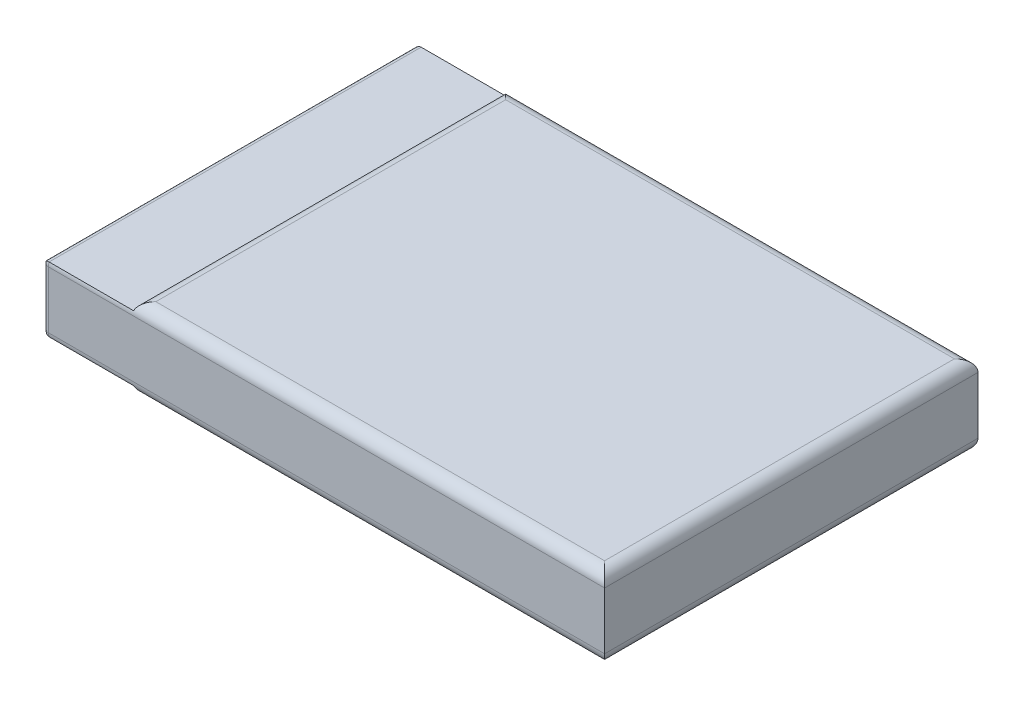
ISO-10303-21;
HEADER;
FILE_DESCRIPTION(('STEP AP214'),'2;1');
FILE_NAME('part.step','',(''),(''),'','','');
FILE_SCHEMA(('AUTOMOTIVE_DESIGN { 1 0 10303 214 1 1 1 1 }'));
ENDSEC;
DATA;
#1=APPLICATION_CONTEXT('core data for automotive mechanical design processes');
#2=APPLICATION_PROTOCOL_DEFINITION('international standard','automotive_design',2000,#1);
#3=PRODUCT_CONTEXT('',#1,'mechanical');
#4=PRODUCT('Part','Part','',(#3));
#5=PRODUCT_RELATED_PRODUCT_CATEGORY('part','',(#4));
#6=PRODUCT_DEFINITION_FORMATION('','',#4);
#7=PRODUCT_DEFINITION_CONTEXT('part definition',#1,'design');
#8=PRODUCT_DEFINITION('design','',#6,#7);
#9=PRODUCT_DEFINITION_SHAPE('','',#8);
#10=(LENGTH_UNIT() NAMED_UNIT(*) SI_UNIT(.MILLI.,.METRE.));
#11=(NAMED_UNIT(*) PLANE_ANGLE_UNIT() SI_UNIT($,.RADIAN.));
#12=(NAMED_UNIT(*) SI_UNIT($,.STERADIAN.) SOLID_ANGLE_UNIT());
#13=UNCERTAINTY_MEASURE_WITH_UNIT(LENGTH_MEASURE(1.E-05),#10,'distance_accuracy_value','');
#14=(GEOMETRIC_REPRESENTATION_CONTEXT(3) GLOBAL_UNCERTAINTY_ASSIGNED_CONTEXT((#13)) GLOBAL_UNIT_ASSIGNED_CONTEXT((#10,
#11,#12)) REPRESENTATION_CONTEXT('',''));
#15=CARTESIAN_POINT('',(0.,0.,0.));
#16=DIRECTION('',(0.,0.,1.));
#17=DIRECTION('',(1.,0.,0.));
#18=AXIS2_PLACEMENT_3D('',#15,#16,#17);
#19=CARTESIAN_POINT('',(15.24,5.207,-12.065));
#20=DIRECTION('',(-1.,0.,0.));
#21=DIRECTION('',(0.,0.,1.));
#22=AXIS2_PLACEMENT_3D('',#19,#20,#21);
#23=PLANE('',#22);
#24=DIRECTION('',(0.,-1.,0.));
#25=VECTOR('',#24,1.);
#26=CARTESIAN_POINT('',(15.24,5.207,-12.065));
#27=LINE('',#26,#25);
#28=CARTESIAN_POINT('',(15.24,4.445,-12.065));
#29=VERTEX_POINT('',#28);
#30=CARTESIAN_POINT('',(15.24,0.762000000000001,-12.065));
#31=VERTEX_POINT('',#30);
#32=EDGE_CURVE('E350',#29,#31,#27,.T.);
#33=ORIENTED_EDGE('',*,*,#32,.F.);
#34=DIRECTION('',(0.,0.,-1.));
#35=VECTOR('',#34,1.);
#36=CARTESIAN_POINT('',(15.24,4.445,12.065));
#37=LINE('',#36,#35);
#38=CARTESIAN_POINT('',(15.24,4.445,12.065));
#39=VERTEX_POINT('',#38);
#40=EDGE_CURVE('E338',#29,#39,#37,.F.);
#41=ORIENTED_EDGE('',*,*,#40,.T.);
#42=DIRECTION('',(0.,-1.,0.));
#43=VECTOR('',#42,1.);
#44=CARTESIAN_POINT('',(15.24,5.207,12.065));
#45=LINE('',#44,#43);
#46=CARTESIAN_POINT('',(15.24,0.762,12.065));
#47=VERTEX_POINT('',#46);
#48=EDGE_CURVE('E342',#39,#47,#45,.T.);
#49=ORIENTED_EDGE('',*,*,#48,.T.);
#50=DIRECTION('',(0.,0.,-1.));
#51=VECTOR('',#50,1.);
#52=CARTESIAN_POINT('',(15.24,0.762,-12.065));
#53=LINE('',#52,#51);
#54=EDGE_CURVE('E372',#47,#31,#53,.T.);
#55=ORIENTED_EDGE('',*,*,#54,.T.);
#56=EDGE_LOOP('',(#33,#41,#49,#55));
#57=FACE_BOUND('',#56,.T.);
#58=ADVANCED_FACE('F37',(#57),#23,.F.);
#59=CARTESIAN_POINT('',(-15.24,5.207,-12.065));
#60=DIRECTION('',(0.,0.,1.));
#61=DIRECTION('',(1.,0.,0.));
#62=AXIS2_PLACEMENT_3D('',#59,#60,#61);
#63=PLANE('',#62);
#64=DIRECTION('',(-1.,0.,0.));
#65=VECTOR('',#64,1.);
#66=CARTESIAN_POINT('',(-15.24,0.762,-12.065));
#67=LINE('',#66,#65);
#68=CARTESIAN_POINT('',(-20.701,0.762,-12.065));
#69=VERTEX_POINT('',#68);
#70=EDGE_CURVE('E195',#31,#69,#67,.T.);
#71=ORIENTED_EDGE('',*,*,#70,.T.);
#72=DIRECTION('',(0.,-1.,0.));
#73=VECTOR('',#72,1.);
#74=CARTESIAN_POINT('',(-20.701,4.445,-12.065));
#75=LINE('',#74,#73);
#76=CARTESIAN_POINT('',(-20.701,4.445,-12.065));
#77=VERTEX_POINT('',#76);
#78=EDGE_CURVE('E262',#69,#77,#75,.F.);
#79=ORIENTED_EDGE('',*,*,#78,.T.);
#80=DIRECTION('',(-1.,0.,0.));
#81=VECTOR('',#80,1.);
#82=CARTESIAN_POINT('',(15.24,4.445,-12.065));
#83=LINE('',#82,#81);
#84=EDGE_CURVE('E371',#77,#29,#83,.F.);
#85=ORIENTED_EDGE('',*,*,#84,.T.);
#86=ORIENTED_EDGE('',*,*,#32,.T.);
#87=EDGE_LOOP('',(#71,#79,#85,#86));
#88=FACE_BOUND('',#87,.T.);
#89=ADVANCED_FACE('F403',(#88),#63,.F.);
#90=CARTESIAN_POINT('',(-15.24,5.207,12.065));
#91=DIRECTION('',(0.,0.,-1.));
#92=DIRECTION('',(-1.,0.,0.));
#93=AXIS2_PLACEMENT_3D('',#90,#91,#92);
#94=PLANE('',#93);
#95=DIRECTION('',(1.,0.,0.));
#96=VECTOR('',#95,1.);
#97=CARTESIAN_POINT('',(-15.24,4.445,12.065));
#98=LINE('',#97,#96);
#99=CARTESIAN_POINT('',(-20.701,4.445,12.065));
#100=VERTEX_POINT('',#99);
#101=EDGE_CURVE('E366',#39,#100,#98,.F.);
#102=ORIENTED_EDGE('',*,*,#101,.T.);
#103=DIRECTION('',(0.,1.,0.));
#104=VECTOR('',#103,1.);
#105=CARTESIAN_POINT('',(-20.701,0.762,12.065));
#106=LINE('',#105,#104);
#107=CARTESIAN_POINT('',(-20.701,0.762,12.065));
#108=VERTEX_POINT('',#107);
#109=EDGE_CURVE('E201',#100,#108,#106,.F.);
#110=ORIENTED_EDGE('',*,*,#109,.T.);
#111=DIRECTION('',(1.,0.,0.));
#112=VECTOR('',#111,1.);
#113=CARTESIAN_POINT('',(-15.24,0.762,12.065));
#114=LINE('',#113,#112);
#115=EDGE_CURVE('E364',#108,#47,#114,.T.);
#116=ORIENTED_EDGE('',*,*,#115,.T.);
#117=ORIENTED_EDGE('',*,*,#48,.F.);
#118=EDGE_LOOP('',(#102,#110,#116,#117));
#119=FACE_BOUND('',#118,.T.);
#120=ADVANCED_FACE('F383',(#119),#94,.F.);
#121=CARTESIAN_POINT('',(0.,5.207,0.));
#122=DIRECTION('',(0.,1.,0.));
#123=DIRECTION('',(0.,0.,1.));
#124=AXIS2_PLACEMENT_3D('',#121,#122,#123);
#125=PLANE('',#124);
#126=DIRECTION('',(-1.,0.,0.));
#127=VECTOR('',#126,1.);
#128=CARTESIAN_POINT('',(-15.24,5.207,-11.303));
#129=LINE('',#128,#127);
#130=CARTESIAN_POINT('',(-14.478,5.207,-11.303));
#131=VERTEX_POINT('',#130);
#132=CARTESIAN_POINT('',(-14.5215795103145,5.207,-11.303));
#133=VERTEX_POINT('',#132);
#134=EDGE_CURVE('E360',#131,#133,#129,.T.);
#135=ORIENTED_EDGE('',*,*,#134,.T.);
#136=DIRECTION('',(0.,0.,1.));
#137=VECTOR('',#136,1.);
#138=CARTESIAN_POINT('',(-14.5215795103145,5.207,12.065));
#139=LINE('',#138,#137);
#140=CARTESIAN_POINT('',(-14.5215795103145,5.207,11.303));
#141=VERTEX_POINT('',#140);
#142=EDGE_CURVE('E362',#133,#141,#139,.T.);
#143=ORIENTED_EDGE('',*,*,#142,.T.);
#144=DIRECTION('',(1.,0.,0.));
#145=VECTOR('',#144,1.);
#146=CARTESIAN_POINT('',(15.24,5.207,11.303));
#147=LINE('',#146,#145);
#148=CARTESIAN_POINT('',(-14.478,5.207,11.303));
#149=VERTEX_POINT('',#148);
#150=EDGE_CURVE('E358',#141,#149,#147,.T.);
#151=ORIENTED_EDGE('',*,*,#150,.T.);
#152=DIRECTION('',(1.,0.,0.));
#153=VECTOR('',#152,1.);
#154=CARTESIAN_POINT('',(15.24,5.207,11.303));
#155=LINE('',#154,#153);
#156=CARTESIAN_POINT('',(14.478,5.207,11.303));
#157=VERTEX_POINT('',#156);
#158=EDGE_CURVE('E89',#149,#157,#155,.T.);
#159=ORIENTED_EDGE('',*,*,#158,.T.);
#160=DIRECTION('',(0.,0.,-1.));
#161=VECTOR('',#160,1.);
#162=CARTESIAN_POINT('',(14.478,5.207,-12.065));
#163=LINE('',#162,#161);
#164=CARTESIAN_POINT('',(14.478,5.207,-11.303));
#165=VERTEX_POINT('',#164);
#166=EDGE_CURVE('E353',#157,#165,#163,.T.);
#167=ORIENTED_EDGE('',*,*,#166,.T.);
#168=DIRECTION('',(-1.,0.,0.));
#169=VECTOR('',#168,1.);
#170=CARTESIAN_POINT('',(-15.24,5.207,-11.303));
#171=LINE('',#170,#169);
#172=EDGE_CURVE('E355',#165,#131,#171,.T.);
#173=ORIENTED_EDGE('',*,*,#172,.T.);
#174=EDGE_LOOP('',(#135,#143,#151,#159,#167,#173));
#175=FACE_BOUND('',#174,.T.);
#176=ADVANCED_FACE('F386',(#175),#125,.T.);
#177=CARTESIAN_POINT('',(0.,0.,0.));
#178=DIRECTION('',(0.,1.,0.));
#179=DIRECTION('',(0.,0.,1.));
#180=AXIS2_PLACEMENT_3D('',#177,#178,#179);
#181=PLANE('',#180);
#182=DIRECTION('',(1.,0.,0.));
#183=VECTOR('',#182,1.);
#184=CARTESIAN_POINT('',(0.,0.,11.303));
#185=LINE('',#184,#183);
#186=CARTESIAN_POINT('',(-14.478,0.,11.303));
#187=VERTEX_POINT('',#186);
#188=CARTESIAN_POINT('',(-14.5215795103145,0.,11.303));
#189=VERTEX_POINT('',#188);
#190=EDGE_CURVE('E327',#187,#189,#185,.F.);
#191=ORIENTED_EDGE('',*,*,#190,.T.);
#192=DIRECTION('',(0.,0.,1.));
#193=VECTOR('',#192,1.);
#194=CARTESIAN_POINT('',(-14.5215795103145,0.,0.));
#195=LINE('',#194,#193);
#196=CARTESIAN_POINT('',(-14.5215795103145,0.,-11.303));
#197=VERTEX_POINT('',#196);
#198=EDGE_CURVE('E304',#189,#197,#195,.F.);
#199=ORIENTED_EDGE('',*,*,#198,.T.);
#200=DIRECTION('',(-1.,0.,0.));
#201=VECTOR('',#200,1.);
#202=CARTESIAN_POINT('',(0.,0.,-11.303));
#203=LINE('',#202,#201);
#204=CARTESIAN_POINT('',(-14.478,0.,-11.303));
#205=VERTEX_POINT('',#204);
#206=EDGE_CURVE('E329',#197,#205,#203,.F.);
#207=ORIENTED_EDGE('',*,*,#206,.T.);
#208=DIRECTION('',(-1.,0.,0.));
#209=VECTOR('',#208,1.);
#210=CARTESIAN_POINT('',(0.,0.,-11.303));
#211=LINE('',#210,#209);
#212=CARTESIAN_POINT('',(14.478,0.,-11.303));
#213=VERTEX_POINT('',#212);
#214=EDGE_CURVE('E332',#205,#213,#211,.F.);
#215=ORIENTED_EDGE('',*,*,#214,.T.);
#216=DIRECTION('',(0.,0.,-1.));
#217=VECTOR('',#216,1.);
#218=CARTESIAN_POINT('',(14.478,0.,0.));
#219=LINE('',#218,#217);
#220=CARTESIAN_POINT('',(14.478,0.,11.303));
#221=VERTEX_POINT('',#220);
#222=EDGE_CURVE('E289',#213,#221,#219,.F.);
#223=ORIENTED_EDGE('',*,*,#222,.T.);
#224=DIRECTION('',(1.,0.,0.));
#225=VECTOR('',#224,1.);
#226=CARTESIAN_POINT('',(0.,0.,11.303));
#227=LINE('',#226,#225);
#228=EDGE_CURVE('E334',#221,#187,#227,.F.);
#229=ORIENTED_EDGE('',*,*,#228,.T.);
#230=EDGE_LOOP('',(#191,#199,#207,#215,#223,#229));
#231=FACE_BOUND('',#230,.T.);
#232=ADVANCED_FACE('F450',(#231),#181,.F.);
#233=CARTESIAN_POINT('',(-21.082,4.699,-12.065));
#234=DIRECTION('',(0.,-1.,0.));
#235=DIRECTION('',(0.,0.,-1.));
#236=AXIS2_PLACEMENT_3D('',#233,#234,#235);
#237=PLANE('',#236);
#238=DIRECTION('',(1.,0.,0.));
#239=VECTOR('',#238,1.);
#240=CARTESIAN_POINT('',(-15.24,4.699,-12.0214204896855));
#241=LINE('',#240,#239);
#242=CARTESIAN_POINT('',(-15.24,4.699,-12.0214204896855));
#243=VERTEX_POINT('',#242);
#244=CARTESIAN_POINT('',(-20.701,4.699,-12.0214204896855));
#245=VERTEX_POINT('',#244);
#246=EDGE_CURVE('E180',#243,#245,#241,.F.);
#247=ORIENTED_EDGE('',*,*,#246,.T.);
#248=DIRECTION('',(0.,0.,-1.));
#249=VECTOR('',#248,1.);
#250=CARTESIAN_POINT('',(-20.701,4.699,12.0214204896855));
#251=LINE('',#250,#249);
#252=CARTESIAN_POINT('',(-20.701,4.699,12.0214204896855));
#253=VERTEX_POINT('',#252);
#254=EDGE_CURVE('E11',#245,#253,#251,.F.);
#255=ORIENTED_EDGE('',*,*,#254,.T.);
#256=DIRECTION('',(-1.,0.,0.));
#257=VECTOR('',#256,1.);
#258=CARTESIAN_POINT('',(-21.082,4.699,12.0214204896855));
#259=LINE('',#258,#257);
#260=CARTESIAN_POINT('',(-15.24,4.699,12.0214204896855));
#261=VERTEX_POINT('',#260);
#262=EDGE_CURVE('E177',#253,#261,#259,.F.);
#263=ORIENTED_EDGE('',*,*,#262,.T.);
#264=DIRECTION('',(0.,0.,-1.));
#265=VECTOR('',#264,1.);
#266=CARTESIAN_POINT('',(-15.24,4.699,-12.065));
#267=LINE('',#266,#265);
#268=EDGE_CURVE('E319',#261,#243,#267,.T.);
#269=ORIENTED_EDGE('',*,*,#268,.T.);
#270=EDGE_LOOP('',(#247,#255,#263,#269));
#271=FACE_BOUND('',#270,.T.);
#272=ADVANCED_FACE('F176',(#271),#237,.F.);
#273=CARTESIAN_POINT('',(-21.082,0.508,-12.065));
#274=DIRECTION('',(0.,1.,0.));
#275=DIRECTION('',(0.,0.,1.));
#276=AXIS2_PLACEMENT_3D('',#273,#274,#275);
#277=PLANE('',#276);
#278=DIRECTION('',(1.,0.,0.));
#279=VECTOR('',#278,1.);
#280=CARTESIAN_POINT('',(-15.24,0.508,12.0214204896855));
#281=LINE('',#280,#279);
#282=CARTESIAN_POINT('',(-15.24,0.508,12.0214204896855));
#283=VERTEX_POINT('',#282);
#284=CARTESIAN_POINT('',(-20.701,0.508,12.0214204896855));
#285=VERTEX_POINT('',#284);
#286=EDGE_CURVE('E276',#283,#285,#281,.F.);
#287=ORIENTED_EDGE('',*,*,#286,.T.);
#288=DIRECTION('',(0.,0.,1.));
#289=VECTOR('',#288,1.);
#290=CARTESIAN_POINT('',(-20.701,0.508,-12.0214204896855));
#291=LINE('',#290,#289);
#292=CARTESIAN_POINT('',(-20.701,0.508,-12.0214204896855));
#293=VERTEX_POINT('',#292);
#294=EDGE_CURVE('E47',#285,#293,#291,.F.);
#295=ORIENTED_EDGE('',*,*,#294,.T.);
#296=DIRECTION('',(-1.,0.,0.));
#297=VECTOR('',#296,1.);
#298=CARTESIAN_POINT('',(-21.082,0.508,-12.0214204896855));
#299=LINE('',#298,#297);
#300=CARTESIAN_POINT('',(-15.24,0.508,-12.0214204896855));
#301=VERTEX_POINT('',#300);
#302=EDGE_CURVE('E274',#293,#301,#299,.F.);
#303=ORIENTED_EDGE('',*,*,#302,.T.);
#304=DIRECTION('',(0.,0.,1.));
#305=VECTOR('',#304,1.);
#306=CARTESIAN_POINT('',(-15.24,0.508,-12.065));
#307=LINE('',#306,#305);
#308=EDGE_CURVE('E339',#301,#283,#307,.T.);
#309=ORIENTED_EDGE('',*,*,#308,.T.);
#310=EDGE_LOOP('',(#287,#295,#303,#309));
#311=FACE_BOUND('',#310,.T.);
#312=ADVANCED_FACE('F273',(#311),#277,.F.);
#313=CARTESIAN_POINT('',(-21.082,0.,0.));
#314=DIRECTION('',(-1.,0.,0.));
#315=DIRECTION('',(0.,0.,1.));
#316=AXIS2_PLACEMENT_3D('',#313,#314,#315);
#317=PLANE('',#316);
#318=DIRECTION('',(0.,-1.,0.));
#319=VECTOR('',#318,1.);
#320=CARTESIAN_POINT('',(-21.082,0.762,-11.684));
#321=LINE('',#320,#319);
#322=CARTESIAN_POINT('',(-21.082,4.318,-11.684));
#323=VERTEX_POINT('',#322);
#324=CARTESIAN_POINT('',(-21.082,0.889,-11.684));
#325=VERTEX_POINT('',#324);
#326=EDGE_CURVE('E257',#323,#325,#321,.T.);
#327=ORIENTED_EDGE('',*,*,#326,.T.);
#328=DIRECTION('',(0.,0.,1.));
#329=VECTOR('',#328,1.);
#330=CARTESIAN_POINT('',(-21.082,0.889,12.0214204896855));
#331=LINE('',#330,#329);
#332=CARTESIAN_POINT('',(-21.082,0.889,11.684));
#333=VERTEX_POINT('',#332);
#334=EDGE_CURVE('E296',#325,#333,#331,.T.);
#335=ORIENTED_EDGE('',*,*,#334,.T.);
#336=DIRECTION('',(0.,1.,0.));
#337=VECTOR('',#336,1.);
#338=CARTESIAN_POINT('',(-21.082,4.445,11.684));
#339=LINE('',#338,#337);
#340=CARTESIAN_POINT('',(-21.082,4.318,11.684));
#341=VERTEX_POINT('',#340);
#342=EDGE_CURVE('E300',#333,#341,#339,.T.);
#343=ORIENTED_EDGE('',*,*,#342,.T.);
#344=DIRECTION('',(0.,0.,-1.));
#345=VECTOR('',#344,1.);
#346=CARTESIAN_POINT('',(-21.082,4.318,-12.0214204896855));
#347=LINE('',#346,#345);
#348=EDGE_CURVE('E302',#341,#323,#347,.T.);
#349=ORIENTED_EDGE('',*,*,#348,.T.);
#350=EDGE_LOOP('',(#327,#335,#343,#349));
#351=FACE_BOUND('',#350,.T.);
#352=ADVANCED_FACE('F400',(#351),#317,.T.);
#353=CARTESIAN_POINT('',(0.,4.445,-11.303));
#354=DIRECTION('',(1.,0.,0.));
#355=DIRECTION('',(0.,0.,-1.));
#356=AXIS2_PLACEMENT_3D('',#353,#354,#355);
#357=CYLINDRICAL_SURFACE('',#356,0.762);
#358=ORIENTED_EDGE('',*,*,#84,.F.);
#359=CARTESIAN_POINT('',(-20.701,4.445,-11.303));
#360=DIRECTION('',(-1.,0.,0.));
#361=DIRECTION('',(0.,0.,1.));
#362=AXIS2_PLACEMENT_3D('',#359,#360,#361);
#363=CIRCLE('',#362,0.762);
#364=EDGE_CURVE('E202',#77,#245,#363,.F.);
#365=ORIENTED_EDGE('',*,*,#364,.T.);
#366=ORIENTED_EDGE('',*,*,#246,.F.);
#367=CARTESIAN_POINT('',(-14.5215795103145,4.445,-11.303));
#368=DIRECTION('',(0.707106781186547,0.,-0.707106781186548));
#369=DIRECTION('',(0.707106781186548,0.,0.707106781186547));
#370=AXIS2_PLACEMENT_3D('',#367,#368,#369);
#371=ELLIPSE('',#370,1.0776307345283,0.762);
#372=EDGE_CURVE('E316',#133,#243,#371,.F.);
#373=ORIENTED_EDGE('',*,*,#372,.F.);
#374=ORIENTED_EDGE('',*,*,#134,.F.);
#375=ORIENTED_EDGE('',*,*,#172,.F.);
#376=CARTESIAN_POINT('',(14.478,4.445,-11.303));
#377=DIRECTION('',(0.707106781186548,0.,0.707106781186547));
#378=DIRECTION('',(-0.707106781186547,0.,0.707106781186548));
#379=AXIS2_PLACEMENT_3D('',#376,#377,#378);
#380=ELLIPSE('',#379,1.0776307345283,0.762);
#381=EDGE_CURVE('E320',#29,#165,#380,.T.);
#382=ORIENTED_EDGE('',*,*,#381,.F.);
#383=EDGE_LOOP('',(#358,#365,#366,#373,#374,#375,#382));
#384=FACE_BOUND('',#383,.T.);
#385=ADVANCED_FACE('F388',(#384),#357,.T.);
#386=CARTESIAN_POINT('',(-14.5215795103145,4.445,-12.065));
#387=DIRECTION('',(0.,0.,-1.));
#388=DIRECTION('',(-1.,0.,0.));
#389=AXIS2_PLACEMENT_3D('',#386,#387,#388);
#390=CYLINDRICAL_SURFACE('',#389,0.762);
#391=ORIENTED_EDGE('',*,*,#372,.T.);
#392=ORIENTED_EDGE('',*,*,#268,.F.);
#393=CARTESIAN_POINT('',(-14.5215795103145,4.445,11.303));
#394=DIRECTION('',(-0.707106781186548,0.,-0.707106781186547));
#395=DIRECTION('',(0.707106781186547,0.,-0.707106781186548));
#396=AXIS2_PLACEMENT_3D('',#393,#394,#395);
#397=ELLIPSE('',#396,1.0776307345283,0.762);
#398=EDGE_CURVE('E194',#141,#261,#397,.F.);
#399=ORIENTED_EDGE('',*,*,#398,.F.);
#400=ORIENTED_EDGE('',*,*,#142,.F.);
#401=EDGE_LOOP('',(#391,#392,#399,#400));
#402=FACE_BOUND('',#401,.T.);
#403=ADVANCED_FACE('F392',(#402),#390,.T.);
#404=CARTESIAN_POINT('',(14.478,4.445,0.));
#405=DIRECTION('',(0.,0.,1.));
#406=DIRECTION('',(1.,0.,0.));
#407=AXIS2_PLACEMENT_3D('',#404,#405,#406);
#408=CYLINDRICAL_SURFACE('',#407,0.762);
#409=ORIENTED_EDGE('',*,*,#381,.T.);
#410=ORIENTED_EDGE('',*,*,#166,.F.);
#411=CARTESIAN_POINT('',(14.478,4.445,11.303));
#412=DIRECTION('',(-0.707106781186547,0.,0.707106781186548));
#413=DIRECTION('',(0.707106781186548,0.,0.707106781186547));
#414=AXIS2_PLACEMENT_3D('',#411,#412,#413);
#415=ELLIPSE('',#414,1.0776307345283,0.762);
#416=EDGE_CURVE('E308',#39,#157,#415,.T.);
#417=ORIENTED_EDGE('',*,*,#416,.F.);
#418=ORIENTED_EDGE('',*,*,#40,.F.);
#419=EDGE_LOOP('',(#409,#410,#417,#418));
#420=FACE_BOUND('',#419,.T.);
#421=ADVANCED_FACE('F384',(#420),#408,.T.);
#422=CARTESIAN_POINT('',(0.,4.445,11.303));
#423=DIRECTION('',(-1.,0.,0.));
#424=DIRECTION('',(0.,0.,1.));
#425=AXIS2_PLACEMENT_3D('',#422,#423,#424);
#426=CYLINDRICAL_SURFACE('',#425,0.762);
#427=ORIENTED_EDGE('',*,*,#262,.F.);
#428=CARTESIAN_POINT('',(-20.701,4.445,11.303));
#429=DIRECTION('',(-1.,0.,0.));
#430=DIRECTION('',(0.,0.,1.));
#431=AXIS2_PLACEMENT_3D('',#428,#429,#430);
#432=CIRCLE('',#431,0.762);
#433=EDGE_CURVE('E190',#253,#100,#432,.F.);
#434=ORIENTED_EDGE('',*,*,#433,.T.);
#435=ORIENTED_EDGE('',*,*,#101,.F.);
#436=ORIENTED_EDGE('',*,*,#416,.T.);
#437=ORIENTED_EDGE('',*,*,#158,.F.);
#438=ORIENTED_EDGE('',*,*,#150,.F.);
#439=ORIENTED_EDGE('',*,*,#398,.T.);
#440=EDGE_LOOP('',(#427,#434,#435,#436,#437,#438,#439));
#441=FACE_BOUND('',#440,.T.);
#442=ADVANCED_FACE('F188',(#441),#426,.T.);
#443=CARTESIAN_POINT('',(-15.24,0.762,11.303));
#444=DIRECTION('',(1.,0.,0.));
#445=DIRECTION('',(0.,0.,-1.));
#446=AXIS2_PLACEMENT_3D('',#443,#444,#445);
#447=CYLINDRICAL_SURFACE('',#446,0.762);
#448=ORIENTED_EDGE('',*,*,#115,.F.);
#449=CARTESIAN_POINT('',(-20.701,0.762,11.303));
#450=DIRECTION('',(-1.,0.,0.));
#451=DIRECTION('',(0.,0.,1.));
#452=AXIS2_PLACEMENT_3D('',#449,#450,#451);
#453=CIRCLE('',#452,0.762);
#454=EDGE_CURVE('E56',#108,#285,#453,.F.);
#455=ORIENTED_EDGE('',*,*,#454,.T.);
#456=ORIENTED_EDGE('',*,*,#286,.F.);
#457=CARTESIAN_POINT('',(-14.5215795103145,0.762,11.303));
#458=DIRECTION('',(0.707106781186548,0.,0.707106781186547));
#459=DIRECTION('',(0.707106781186547,0.,-0.707106781186548));
#460=AXIS2_PLACEMENT_3D('',#457,#458,#459);
#461=ELLIPSE('',#460,1.0776307345283,0.762);
#462=EDGE_CURVE('E309',#189,#283,#461,.F.);
#463=ORIENTED_EDGE('',*,*,#462,.F.);
#464=ORIENTED_EDGE('',*,*,#190,.F.);
#465=ORIENTED_EDGE('',*,*,#228,.F.);
#466=CARTESIAN_POINT('',(14.478,0.762,11.303));
#467=DIRECTION('',(0.707106781186547,0.,-0.707106781186548));
#468=DIRECTION('',(-0.707106781186548,0.,-0.707106781186547));
#469=AXIS2_PLACEMENT_3D('',#466,#467,#468);
#470=ELLIPSE('',#469,1.0776307345283,0.762);
#471=EDGE_CURVE('E305',#47,#221,#470,.T.);
#472=ORIENTED_EDGE('',*,*,#471,.F.);
#473=EDGE_LOOP('',(#448,#455,#456,#463,#464,#465,#472));
#474=FACE_BOUND('',#473,.T.);
#475=ADVANCED_FACE('F234',(#474),#447,.T.);
#476=CARTESIAN_POINT('',(14.478,0.762,-12.065));
#477=DIRECTION('',(0.,0.,-1.));
#478=DIRECTION('',(-1.,0.,0.));
#479=AXIS2_PLACEMENT_3D('',#476,#477,#478);
#480=CYLINDRICAL_SURFACE('',#479,0.762);
#481=ORIENTED_EDGE('',*,*,#471,.T.);
#482=ORIENTED_EDGE('',*,*,#222,.F.);
#483=CARTESIAN_POINT('',(14.478,0.762,-11.303));
#484=DIRECTION('',(-0.707106781186548,0.,-0.707106781186547));
#485=DIRECTION('',(0.707106781186547,0.,-0.707106781186548));
#486=AXIS2_PLACEMENT_3D('',#483,#484,#485);
#487=ELLIPSE('',#486,1.0776307345283,0.762);
#488=EDGE_CURVE('E312',#31,#213,#487,.T.);
#489=ORIENTED_EDGE('',*,*,#488,.F.);
#490=ORIENTED_EDGE('',*,*,#54,.F.);
#491=EDGE_LOOP('',(#481,#482,#489,#490));
#492=FACE_BOUND('',#491,.T.);
#493=ADVANCED_FACE('F416',(#492),#480,.T.);
#494=CARTESIAN_POINT('',(-14.5215795103145,0.762,-12.065));
#495=DIRECTION('',(0.,0.,1.));
#496=DIRECTION('',(1.,0.,0.));
#497=AXIS2_PLACEMENT_3D('',#494,#495,#496);
#498=CYLINDRICAL_SURFACE('',#497,0.762);
#499=ORIENTED_EDGE('',*,*,#462,.T.);
#500=ORIENTED_EDGE('',*,*,#308,.F.);
#501=CARTESIAN_POINT('',(-14.5215795103145,0.762,-11.303));
#502=DIRECTION('',(-0.707106781186547,0.,0.707106781186548));
#503=DIRECTION('',(0.707106781186548,0.,0.707106781186547));
#504=AXIS2_PLACEMENT_3D('',#501,#502,#503);
#505=ELLIPSE('',#504,1.0776307345283,0.762);
#506=EDGE_CURVE('E288',#197,#301,#505,.F.);
#507=ORIENTED_EDGE('',*,*,#506,.F.);
#508=ORIENTED_EDGE('',*,*,#198,.F.);
#509=EDGE_LOOP('',(#499,#500,#507,#508));
#510=FACE_BOUND('',#509,.T.);
#511=ADVANCED_FACE('F420',(#510),#498,.T.);
#512=CARTESIAN_POINT('',(-15.24,0.762,-11.303));
#513=DIRECTION('',(-1.,0.,0.));
#514=DIRECTION('',(0.,0.,1.));
#515=AXIS2_PLACEMENT_3D('',#512,#513,#514);
#516=CYLINDRICAL_SURFACE('',#515,0.762);
#517=ORIENTED_EDGE('',*,*,#302,.F.);
#518=CARTESIAN_POINT('',(-20.701,0.762,-11.303));
#519=DIRECTION('',(-1.,0.,0.));
#520=DIRECTION('',(0.,0.,1.));
#521=AXIS2_PLACEMENT_3D('',#518,#519,#520);
#522=CIRCLE('',#521,0.762);
#523=EDGE_CURVE('E264',#293,#69,#522,.F.);
#524=ORIENTED_EDGE('',*,*,#523,.T.);
#525=ORIENTED_EDGE('',*,*,#70,.F.);
#526=ORIENTED_EDGE('',*,*,#488,.T.);
#527=ORIENTED_EDGE('',*,*,#214,.F.);
#528=ORIENTED_EDGE('',*,*,#206,.F.);
#529=ORIENTED_EDGE('',*,*,#506,.T.);
#530=EDGE_LOOP('',(#517,#524,#525,#526,#527,#528,#529));
#531=FACE_BOUND('',#530,.T.);
#532=ADVANCED_FACE('F282',(#531),#516,.T.);
#533=CARTESIAN_POINT('',(-20.701,0.762,11.303));
#534=DIRECTION('',(-1.,0.,0.));
#535=DIRECTION('',(0.,0.,1.));
#536=AXIS2_PLACEMENT_3D('',#533,#534,#535);
#537=DEGENERATE_TOROIDAL_SURFACE('',#536,0.381,0.381,.T.);
#538=CARTESIAN_POINT('',(-20.701,0.508,12.0214204896855));
#539=CARTESIAN_POINT('',(-20.7194122552725,0.50797313538543,12.0214322788709));
#540=CARTESIAN_POINT('',(-20.7378028049788,0.509332860232536,12.0204779573073));
#541=CARTESIAN_POINT('',(-20.7739371299452,0.514610639128594,12.0167350891165));
#542=CARTESIAN_POINT('',(-20.7916835050501,0.518516821578674,12.0139550535355));
#543=CARTESIAN_POINT('',(-20.826090784612,0.528671675327895,12.0066604333865));
#544=CARTESIAN_POINT('',(-20.8427526440908,0.534918252007761,12.0021473997372));
#545=CARTESIAN_POINT('',(-20.8746412563976,0.549417068591312,11.9915321845903));
#546=CARTESIAN_POINT('',(-20.8898667848668,0.557670998543022,11.9854286637048));
#547=CARTESIAN_POINT('',(-20.9193355400912,0.576255236929559,11.9714547474546));
#548=CARTESIAN_POINT('',(-20.9334907253585,0.586669158385011,11.9635108704546));
#549=CARTESIAN_POINT('',(-20.95976271856,0.608824142930813,11.9462458599269));
#550=CARTESIAN_POINT('',(-20.9718790299132,0.620565528172856,11.9369243919132));
#551=CARTESIAN_POINT('',(-20.9957503611597,0.646833026261717,11.9155395784471));
#552=CARTESIAN_POINT('',(-21.0071594896697,0.66150893419596,11.9032751478372));
#553=CARTESIAN_POINT('',(-21.0272965602084,0.691469481925239,11.8773617575332));
#554=CARTESIAN_POINT('',(-21.0360214365415,0.706754795393808,11.8637112382634));
#555=CARTESIAN_POINT('',(-21.0551507685122,0.746012711577285,11.8272142737218));
#556=CARTESIAN_POINT('',(-21.0637603523981,0.770057435758865,11.8034983970064));
#557=CARTESIAN_POINT('',(-21.0758673418,0.816763624127507,11.7536081148253));
#558=CARTESIAN_POINT('',(-21.0793648851053,0.839425125581997,11.7274337756448));
#559=CARTESIAN_POINT('',(-21.0816123355579,0.869637087019923,11.6887900393003));
#560=CARTESIAN_POINT('',(-21.081941675004,0.878289175585475,11.6772355214753));
#561=CARTESIAN_POINT('',(-21.0819976414672,0.887450141901424,11.6643970721437));
#562=CARTESIAN_POINT('',(-21.0819999986076,0.888226248569482,11.6633044911396));
#563=CARTESIAN_POINT('',(-21.082,0.889,11.6622102448428));
#564=B_SPLINE_CURVE_WITH_KNOTS('',3,(#538,#539,#540,#541,#542,#543,#544,#545,#546,#547,#548,
#549,#550,#551,#552,#553,#554,#555,#556,#557,#558,#559,#560,#561,#562,#563),.UNSPECIFIED.,.F.,
.F.,(4,2,2,2,2,2,2,2,2,2,2,2,4),(0.,0.0551278602073709,0.110000534465438,0.164824215325304,
0.219694214578651,0.277326569646748,0.334972941199699,0.401537640384023,0.468178083557398,
0.572131532916632,0.676082180276539,0.719377150521074,0.723397671155833),.UNSPECIFIED.);
#565=CARTESIAN_POINT('',(-21.0602102448432,0.762000000001256,11.8109999999987));
#566=VERTEX_POINT('',#565);
#567=EDGE_CURVE('E210',#285,#566,#564,.T.);
#568=ORIENTED_EDGE('',*,*,#567,.F.);
#569=ORIENTED_EDGE('',*,*,#454,.F.);
#570=CARTESIAN_POINT('',(-20.701,0.762,11.684));
#571=DIRECTION('',(0.,1.,0.));
#572=DIRECTION('',(0.,0.,1.));
#573=AXIS2_PLACEMENT_3D('',#570,#571,#572);
#574=CIRCLE('',#573,0.381);
#575=EDGE_CURVE('E80',#566,#108,#574,.T.);
#576=ORIENTED_EDGE('',*,*,#575,.F.);
#577=EDGE_LOOP('',(#568,#569,#576));
#578=FACE_BOUND('',#577,.T.);
#579=ADVANCED_FACE('F423',(#578),#537,.T.);
#580=CARTESIAN_POINT('',(-20.701,4.445,11.303));
#581=DIRECTION('',(-1.,0.,0.));
#582=DIRECTION('',(0.,0.,1.));
#583=AXIS2_PLACEMENT_3D('',#580,#581,#582);
#584=DEGENERATE_TOROIDAL_SURFACE('',#583,0.381,0.381,.T.);
#585=CARTESIAN_POINT('',(-20.701,4.445,11.684));
#586=DIRECTION('',(0.,-1.,0.));
#587=DIRECTION('',(0.,0.,-1.));
#588=AXIS2_PLACEMENT_3D('',#585,#586,#587);
#589=CIRCLE('',#588,0.381);
#590=CARTESIAN_POINT('',(-21.0602102448432,4.44499999999875,11.8109999999987));
#591=VERTEX_POINT('',#590);
#592=EDGE_CURVE('E41',#100,#591,#589,.T.);
#593=ORIENTED_EDGE('',*,*,#592,.F.);
#594=ORIENTED_EDGE('',*,*,#433,.F.);
#595=CARTESIAN_POINT('',(-20.701,4.699,12.0214204896855));
#596=CARTESIAN_POINT('',(-20.7194122552725,4.69902686461457,12.0214322788709));
#597=CARTESIAN_POINT('',(-20.7378028049788,4.69766713976747,12.0204779573073));
#598=CARTESIAN_POINT('',(-20.7739371299452,4.69238936087141,12.0167350891165));
#599=CARTESIAN_POINT('',(-20.7916835050501,4.68848317842133,12.0139550535355));
#600=CARTESIAN_POINT('',(-20.826090784612,4.67832832467211,12.0066604333865));
#601=CARTESIAN_POINT('',(-20.8427526440908,4.67208174799224,12.0021473997372));
#602=CARTESIAN_POINT('',(-20.8746412563976,4.65758293140869,11.9915321845903));
#603=CARTESIAN_POINT('',(-20.8898667848668,4.64932900145698,11.9854286637048));
#604=CARTESIAN_POINT('',(-20.9193355400912,4.63074476307044,11.9714547474546));
#605=CARTESIAN_POINT('',(-20.9334907253585,4.62033084161499,11.9635108704546));
#606=CARTESIAN_POINT('',(-20.95976271856,4.59817585706919,11.9462458599269));
#607=CARTESIAN_POINT('',(-20.9718790299132,4.58643447182714,11.9369243919132));
#608=CARTESIAN_POINT('',(-20.9957503611597,4.56016697373828,11.9155395784471));
#609=CARTESIAN_POINT('',(-21.0071594896697,4.54549106580404,11.9032751478372));
#610=CARTESIAN_POINT('',(-21.0272965602084,4.51553051807476,11.8773617575332));
#611=CARTESIAN_POINT('',(-21.0360214365415,4.50024520460619,11.8637112382634));
#612=CARTESIAN_POINT('',(-21.0551507685122,4.46098728842272,11.8272142737218));
#613=CARTESIAN_POINT('',(-21.0637603523981,4.43694256424114,11.8034983970065));
#614=CARTESIAN_POINT('',(-21.0758673418,4.39023637587249,11.7536081148253));
#615=CARTESIAN_POINT('',(-21.0793648851053,4.36757487441801,11.7274337756448));
#616=CARTESIAN_POINT('',(-21.0816123355579,4.33736291298008,11.6887900393003));
#617=CARTESIAN_POINT('',(-21.081941675004,4.32871082441452,11.6772355214753));
#618=CARTESIAN_POINT('',(-21.0819976414672,4.31954985809858,11.6643970721437));
#619=CARTESIAN_POINT('',(-21.0819999986076,4.31877375143052,11.6633044911396));
#620=CARTESIAN_POINT('',(-21.082,4.318,11.6622102448428));
#621=B_SPLINE_CURVE_WITH_KNOTS('',3,(#595,#596,#597,#598,#599,#600,#601,#602,#603,#604,#605,
#606,#607,#608,#609,#610,#611,#612,#613,#614,#615,#616,#617,#618,#619,#620),.UNSPECIFIED.,.F.,
.F.,(4,2,2,2,2,2,2,2,2,2,2,2,4),(0.,0.0551278602073709,0.110000534465438,0.164824215325304,
0.219694214578651,0.277326569646748,0.334972941199699,0.401537640384024,0.468178083557398,
0.572131532916629,0.676082180276539,0.719377150521071,0.723397671155832),.UNSPECIFIED.);
#622=EDGE_CURVE('E199',#591,#253,#621,.F.);
#623=ORIENTED_EDGE('',*,*,#622,.F.);
#624=EDGE_LOOP('',(#593,#594,#623));
#625=FACE_BOUND('',#624,.T.);
#626=ADVANCED_FACE('F198',(#625),#584,.T.);
#627=CARTESIAN_POINT('',(-20.701,0.,11.684));
#628=DIRECTION('',(0.,-1.,0.));
#629=DIRECTION('',(1.,0.,0.));
#630=AXIS2_PLACEMENT_3D('',#627,#628,#629);
#631=CYLINDRICAL_SURFACE('',#630,0.381);
#632=CARTESIAN_POINT('',(-20.701,4.318,11.684));
#633=DIRECTION('',(0.,-0.707106781186547,0.707106781186547));
#634=DIRECTION('',(0.,0.707106781186547,0.707106781186547));
#635=AXIS2_PLACEMENT_3D('',#632,#633,#634);
#636=ELLIPSE('',#635,0.538815367264149,0.381);
#637=EDGE_CURVE('E207',#341,#591,#636,.F.);
#638=ORIENTED_EDGE('',*,*,#637,.F.);
#639=ORIENTED_EDGE('',*,*,#342,.F.);
#640=CARTESIAN_POINT('',(-20.701,0.889,11.684));
#641=DIRECTION('',(0.,-0.707106781186547,-0.707106781186547));
#642=DIRECTION('',(0.,0.707106781186547,-0.707106781186547));
#643=AXIS2_PLACEMENT_3D('',#640,#641,#642);
#644=ELLIPSE('',#643,0.538815367264149,0.381);
#645=EDGE_CURVE('E426',#566,#333,#644,.T.);
#646=ORIENTED_EDGE('',*,*,#645,.F.);
#647=ORIENTED_EDGE('',*,*,#575,.T.);
#648=ORIENTED_EDGE('',*,*,#109,.F.);
#649=ORIENTED_EDGE('',*,*,#592,.T.);
#650=EDGE_LOOP('',(#638,#639,#646,#647,#648,#649));
#651=FACE_BOUND('',#650,.T.);
#652=ADVANCED_FACE('F39',(#651),#631,.T.);
#653=CARTESIAN_POINT('',(-20.701,0.889,0.));
#654=DIRECTION('',(0.,0.,-1.));
#655=DIRECTION('',(-1.,0.,0.));
#656=AXIS2_PLACEMENT_3D('',#653,#654,#655);
#657=CYLINDRICAL_SURFACE('',#656,0.381);
#658=CARTESIAN_POINT('',(-20.701,0.508,-12.0214204896855));
#659=CARTESIAN_POINT('',(-20.7194122552725,0.50797313538543,-12.0214322788709));
#660=CARTESIAN_POINT('',(-20.7378028049788,0.509332860232535,-12.0204779573073));
#661=CARTESIAN_POINT('',(-20.7739371299452,0.514610639128593,-12.0167350891165));
#662=CARTESIAN_POINT('',(-20.7916835050501,0.518516821578673,-12.0139550535355));
#663=CARTESIAN_POINT('',(-20.826090784612,0.528671675327893,-12.0066604333865));
#664=CARTESIAN_POINT('',(-20.8427526440908,0.534918252007759,-12.0021473997372));
#665=CARTESIAN_POINT('',(-20.8746412563976,0.54941706859131,-11.9915321845903));
#666=CARTESIAN_POINT('',(-20.8898667848668,0.55767099854302,-11.9854286637048));
#667=CARTESIAN_POINT('',(-20.9193355400912,0.576255236929558,-11.9714547474546));
#668=CARTESIAN_POINT('',(-20.9334907253585,0.58666915838501,-11.9635108704546));
#669=CARTESIAN_POINT('',(-20.95976271856,0.608824142930812,-11.9462458599269));
#670=CARTESIAN_POINT('',(-20.9718790299132,0.620565528172856,-11.9369243919132));
#671=CARTESIAN_POINT('',(-20.9957503611597,0.646833026261705,-11.9155395784471));
#672=CARTESIAN_POINT('',(-21.0071594896697,0.661508934195935,-11.9032751478372));
#673=CARTESIAN_POINT('',(-21.0272965602084,0.691469481925229,-11.8773617575332));
#674=CARTESIAN_POINT('',(-21.0360214365415,0.706754795393827,-11.8637112382634));
#675=CARTESIAN_POINT('',(-21.0551507685122,0.746012711577262,-11.8272142737217));
#676=CARTESIAN_POINT('',(-21.0637603523981,0.77005743575869,-11.8034983970062));
#677=CARTESIAN_POINT('',(-21.0758673418,0.816763624127794,-11.7536081148254));
#678=CARTESIAN_POINT('',(-21.0793648851053,0.839425125582901,-11.7274337756454));
#679=CARTESIAN_POINT('',(-21.0816123355579,0.86963708701952,-11.6887900393));
#680=CARTESIAN_POINT('',(-21.081941675004,0.878289175584427,-11.6772355214746));
#681=CARTESIAN_POINT('',(-21.0819976414672,0.887450141901239,-11.6643970721436));
#682=CARTESIAN_POINT('',(-21.0819999986076,0.888226248569382,-11.6633044911395));
#683=CARTESIAN_POINT('',(-21.082,0.889,-11.6622102448428));
#684=B_SPLINE_CURVE_WITH_KNOTS('',3,(#658,#659,#660,#661,#662,#663,#664,#665,#666,#667,#668,
#669,#670,#671,#672,#673,#674,#675,#676,#677,#678,#679,#680,#681,#682,#683),.UNSPECIFIED.,.F.,
.F.,(4,2,2,2,2,2,2,2,2,2,2,2,4),(0.,0.0551278602073709,0.110000534465438,0.164824215325304,
0.219694214578651,0.277326569646756,0.334972941199698,0.401537640383991,0.468178083557398,
0.572131532916774,0.67608218027653,0.719377150521063,0.723397671155824),.UNSPECIFIED.);
#685=CARTESIAN_POINT('',(-21.0602102448432,0.762,-11.8109999999987));
#686=VERTEX_POINT('',#685);
#687=EDGE_CURVE('E208',#293,#686,#684,.T.);
#688=ORIENTED_EDGE('',*,*,#687,.F.);
#689=ORIENTED_EDGE('',*,*,#294,.F.);
#690=ORIENTED_EDGE('',*,*,#567,.T.);
#691=ORIENTED_EDGE('',*,*,#645,.T.);
#692=ORIENTED_EDGE('',*,*,#334,.F.);
#693=CARTESIAN_POINT('',(-20.701,0.889,-11.684));
#694=DIRECTION('',(0.,0.707106781186547,-0.707106781186547));
#695=DIRECTION('',(0.,-0.707106781186547,-0.707106781186547));
#696=AXIS2_PLACEMENT_3D('',#693,#694,#695);
#697=ELLIPSE('',#696,0.538815367264149,0.381);
#698=EDGE_CURVE('E250',#686,#325,#697,.T.);
#699=ORIENTED_EDGE('',*,*,#698,.F.);
#700=EDGE_LOOP('',(#688,#689,#690,#691,#692,#699));
#701=FACE_BOUND('',#700,.T.);
#702=ADVANCED_FACE('F292',(#701),#657,.T.);
#703=CARTESIAN_POINT('',(-20.701,0.762,-11.303));
#704=DIRECTION('',(-1.,0.,0.));
#705=DIRECTION('',(0.,0.,1.));
#706=AXIS2_PLACEMENT_3D('',#703,#704,#705);
#707=DEGENERATE_TOROIDAL_SURFACE('',#706,0.381,0.381,.T.);
#708=ORIENTED_EDGE('',*,*,#523,.F.);
#709=ORIENTED_EDGE('',*,*,#687,.T.);
#710=CARTESIAN_POINT('',(-20.701,0.762,-11.684));
#711=DIRECTION('',(0.,1.,0.));
#712=DIRECTION('',(0.,0.,1.));
#713=AXIS2_PLACEMENT_3D('',#710,#711,#712);
#714=CIRCLE('',#713,0.381);
#715=EDGE_CURVE('E246',#69,#686,#714,.T.);
#716=ORIENTED_EDGE('',*,*,#715,.F.);
#717=EDGE_LOOP('',(#708,#709,#716));
#718=FACE_BOUND('',#717,.T.);
#719=ADVANCED_FACE('F233',(#718),#707,.T.);
#720=CARTESIAN_POINT('',(-20.701,4.318,0.));
#721=DIRECTION('',(0.,0.,1.));
#722=DIRECTION('',(1.,0.,0.));
#723=AXIS2_PLACEMENT_3D('',#720,#721,#722);
#724=CYLINDRICAL_SURFACE('',#723,0.381);
#725=CARTESIAN_POINT('',(-20.701,4.318,-11.684));
#726=DIRECTION('',(0.,0.707106781186547,0.707106781186547));
#727=DIRECTION('',(0.,-0.707106781186547,0.707106781186547));
#728=AXIS2_PLACEMENT_3D('',#725,#726,#727);
#729=ELLIPSE('',#728,0.538815367264149,0.381);
#730=CARTESIAN_POINT('',(-21.0602102448432,4.445,-11.8109999999987));
#731=VERTEX_POINT('',#730);
#732=EDGE_CURVE('E212',#323,#731,#729,.F.);
#733=ORIENTED_EDGE('',*,*,#732,.F.);
#734=ORIENTED_EDGE('',*,*,#348,.F.);
#735=ORIENTED_EDGE('',*,*,#637,.T.);
#736=ORIENTED_EDGE('',*,*,#622,.T.);
#737=ORIENTED_EDGE('',*,*,#254,.F.);
#738=CARTESIAN_POINT('',(-20.701,4.699,-12.0214204896855));
#739=CARTESIAN_POINT('',(-20.7194122552725,4.69902686461457,-12.0214322788709));
#740=CARTESIAN_POINT('',(-20.7378028049788,4.69766713976747,-12.0204779573073));
#741=CARTESIAN_POINT('',(-20.7739371299452,4.69238936087141,-12.0167350891165));
#742=CARTESIAN_POINT('',(-20.7916835050501,4.68848317842133,-12.0139550535355));
#743=CARTESIAN_POINT('',(-20.826090784612,4.67832832467211,-12.0066604333865));
#744=CARTESIAN_POINT('',(-20.8427526440908,4.67208174799224,-12.0021473997372));
#745=CARTESIAN_POINT('',(-20.8746412563976,4.65758293140869,-11.9915321845903));
#746=CARTESIAN_POINT('',(-20.8898667848668,4.64932900145698,-11.9854286637048));
#747=CARTESIAN_POINT('',(-20.9193355400912,4.63074476307044,-11.9714547474546));
#748=CARTESIAN_POINT('',(-20.9334907253585,4.62033084161499,-11.9635108704546));
#749=CARTESIAN_POINT('',(-20.95976271856,4.59817585706919,-11.9462458599269));
#750=CARTESIAN_POINT('',(-20.9718790299132,4.58643447182714,-11.9369243919132));
#751=CARTESIAN_POINT('',(-20.9957503611597,4.5601669737383,-11.9155395784471));
#752=CARTESIAN_POINT('',(-21.0071594896697,4.54549106580407,-11.9032751478372));
#753=CARTESIAN_POINT('',(-21.0272965602084,4.51553051807477,-11.8773617575332));
#754=CARTESIAN_POINT('',(-21.0360214365415,4.50024520460617,-11.8637112382634));
#755=CARTESIAN_POINT('',(-21.0551507685122,4.46098728842273,-11.8272142737217));
#756=CARTESIAN_POINT('',(-21.0637603523981,4.43694256424131,-11.8034983970062));
#757=CARTESIAN_POINT('',(-21.0758673418,4.39023637587221,-11.7536081148254));
#758=CARTESIAN_POINT('',(-21.0793648851053,4.3675748744171,-11.7274337756454));
#759=CARTESIAN_POINT('',(-21.0816123355579,4.33736291298048,-11.6887900393));
#760=CARTESIAN_POINT('',(-21.081941675004,4.32871082441557,-11.6772355214746));
#761=CARTESIAN_POINT('',(-21.0819976414672,4.31954985809876,-11.6643970721436));
#762=CARTESIAN_POINT('',(-21.0819999986076,4.31877375143062,-11.6633044911395));
#763=CARTESIAN_POINT('',(-21.082,4.318,-11.6622102448428));
#764=B_SPLINE_CURVE_WITH_KNOTS('',3,(#738,#739,#740,#741,#742,#743,#744,#745,#746,#747,#748,
#749,#750,#751,#752,#753,#754,#755,#756,#757,#758,#759,#760,#761,#762,#763),.UNSPECIFIED.,.F.,
.F.,(4,2,2,2,2,2,2,2,2,2,2,2,4),(0.,0.0551278602073709,0.110000534465438,0.164824215325304,
0.219694214578651,0.277326569646756,0.334972941199699,0.401537640383991,0.468178083557403,
0.572131532916776,0.67608218027653,0.719377150521063,0.723397671155824),.UNSPECIFIED.);
#765=EDGE_CURVE('E240',#731,#245,#764,.F.);
#766=ORIENTED_EDGE('',*,*,#765,.F.);
#767=EDGE_LOOP('',(#733,#734,#735,#736,#737,#766));
#768=FACE_BOUND('',#767,.T.);
#769=ADVANCED_FACE('F205',(#768),#724,.T.);
#770=CARTESIAN_POINT('',(-20.701,0.,-11.684));
#771=DIRECTION('',(0.,1.,0.));
#772=DIRECTION('',(-1.,0.,0.));
#773=AXIS2_PLACEMENT_3D('',#770,#771,#772);
#774=CYLINDRICAL_SURFACE('',#773,0.381);
#775=ORIENTED_EDGE('',*,*,#326,.F.);
#776=ORIENTED_EDGE('',*,*,#732,.T.);
#777=CARTESIAN_POINT('',(-20.701,4.445,-11.684));
#778=DIRECTION('',(0.,1.,0.));
#779=DIRECTION('',(0.,0.,1.));
#780=AXIS2_PLACEMENT_3D('',#777,#778,#779);
#781=CIRCLE('',#780,0.381);
#782=EDGE_CURVE('E247',#77,#731,#781,.T.);
#783=ORIENTED_EDGE('',*,*,#782,.F.);
#784=ORIENTED_EDGE('',*,*,#78,.F.);
#785=ORIENTED_EDGE('',*,*,#715,.T.);
#786=ORIENTED_EDGE('',*,*,#698,.T.);
#787=EDGE_LOOP('',(#775,#776,#783,#784,#785,#786));
#788=FACE_BOUND('',#787,.T.);
#789=ADVANCED_FACE('F232',(#788),#774,.T.);
#790=CARTESIAN_POINT('',(-20.701,4.445,-11.303));
#791=DIRECTION('',(-1.,0.,0.));
#792=DIRECTION('',(0.,0.,1.));
#793=AXIS2_PLACEMENT_3D('',#790,#791,#792);
#794=DEGENERATE_TOROIDAL_SURFACE('',#793,0.381,0.381,.T.);
#795=ORIENTED_EDGE('',*,*,#765,.T.);
#796=ORIENTED_EDGE('',*,*,#364,.F.);
#797=ORIENTED_EDGE('',*,*,#782,.T.);
#798=EDGE_LOOP('',(#795,#796,#797));
#799=FACE_BOUND('',#798,.T.);
#800=ADVANCED_FACE('F236',(#799),#794,.T.);
#801=CLOSED_SHELL('',(#58,#89,#120,#176,#232,#272,#312,#352,#385,#403,#421,#442,#475,#493,#511,
#532,#579,#626,#652,#702,#719,#769,#789,#800));
#802=MANIFOLD_SOLID_BREP('B2',#801);
#803=ADVANCED_BREP_SHAPE_REPRESENTATION('',(#18,#802),#14);
#804=SHAPE_DEFINITION_REPRESENTATION(#9,#803);
ENDSEC;
END-ISO-10303-21;
